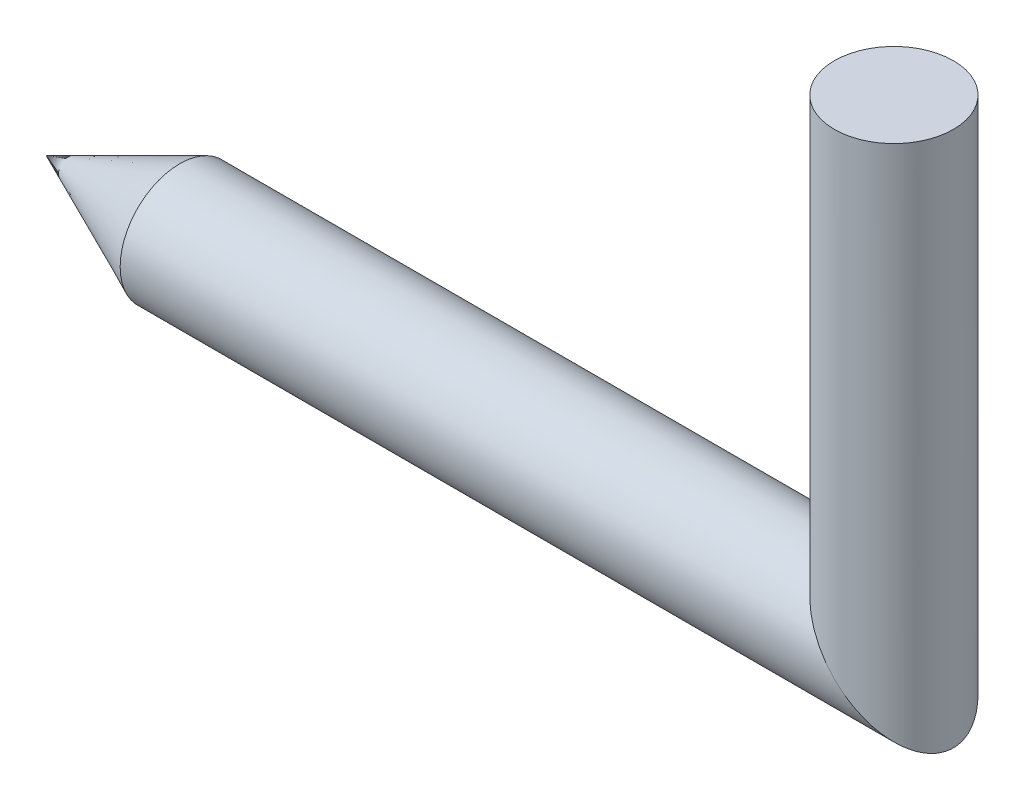
ISO-10303-21;
HEADER;
FILE_DESCRIPTION(('STEP AP214'),'2;1');
FILE_NAME('part.step','',(''),(''),'','','');
FILE_SCHEMA(('AUTOMOTIVE_DESIGN { 1 0 10303 214 1 1 1 1 }'));
ENDSEC;
DATA;
#1=APPLICATION_CONTEXT('core data for automotive mechanical design processes');
#2=APPLICATION_PROTOCOL_DEFINITION('international standard','automotive_design',2000,#1);
#3=PRODUCT_CONTEXT('',#1,'mechanical');
#4=PRODUCT('Part','Part','',(#3));
#5=PRODUCT_RELATED_PRODUCT_CATEGORY('part','',(#4));
#6=PRODUCT_DEFINITION_FORMATION('','',#4);
#7=PRODUCT_DEFINITION_CONTEXT('part definition',#1,'design');
#8=PRODUCT_DEFINITION('design','',#6,#7);
#9=PRODUCT_DEFINITION_SHAPE('','',#8);
#10=(LENGTH_UNIT() NAMED_UNIT(*) SI_UNIT(.MILLI.,.METRE.));
#11=(NAMED_UNIT(*) PLANE_ANGLE_UNIT() SI_UNIT($,.RADIAN.));
#12=(NAMED_UNIT(*) SI_UNIT($,.STERADIAN.) SOLID_ANGLE_UNIT());
#13=UNCERTAINTY_MEASURE_WITH_UNIT(LENGTH_MEASURE(1.E-05),#10,'distance_accuracy_value','');
#14=(GEOMETRIC_REPRESENTATION_CONTEXT(3) GLOBAL_UNCERTAINTY_ASSIGNED_CONTEXT((#13)) GLOBAL_UNIT_ASSIGNED_CONTEXT((#10,
#11,#12)) REPRESENTATION_CONTEXT('',''));
#15=CARTESIAN_POINT('',(0.,0.,0.));
#16=DIRECTION('',(0.,0.,1.));
#17=DIRECTION('',(1.,0.,0.));
#18=AXIS2_PLACEMENT_3D('',#15,#16,#17);
#19=CARTESIAN_POINT('',(40.1728214285714,4.,0.));
#20=DIRECTION('',(0.,-1.,0.));
#21=DIRECTION('',(0.,0.,-1.));
#22=AXIS2_PLACEMENT_3D('',#19,#20,#21);
#23=PLANE('',#22);
#24=CARTESIAN_POINT('',(40.1728214285714,4.,0.));
#25=DIRECTION('',(0.,-1.,0.));
#26=DIRECTION('',(0.,0.,-1.));
#27=AXIS2_PLACEMENT_3D('',#24,#25,#26);
#28=CIRCLE('',#27,0.499999999999999);
#29=CARTESIAN_POINT('',(40.1728214285714,4.,-0.499999999999999));
#30=VERTEX_POINT('',#29);
#31=CARTESIAN_POINT('',(40.1728214285714,4.,0.499999999999999));
#32=VERTEX_POINT('',#31);
#33=EDGE_CURVE('E110',#30,#32,#28,.T.);
#34=ORIENTED_EDGE('',*,*,#33,.F.);
#35=CARTESIAN_POINT('',(40.1728214285714,4.,0.));
#36=DIRECTION('',(0.,-1.,0.));
#37=DIRECTION('',(0.,0.,1.));
#38=AXIS2_PLACEMENT_3D('',#35,#36,#37);
#39=CIRCLE('',#38,0.499999999999999);
#40=EDGE_CURVE('E46',#32,#30,#39,.T.);
#41=ORIENTED_EDGE('',*,*,#40,.F.);
#42=EDGE_LOOP('',(#34,#41));
#43=FACE_BOUND('',#42,.T.);
#44=ADVANCED_FACE('F17',(#43),#23,.F.);
#45=CARTESIAN_POINT('',(40.1728214285714,-1.41421356237309,0.));
#46=DIRECTION('',(0.,1.,0.));
#47=DIRECTION('',(0.,0.,1.));
#48=AXIS2_PLACEMENT_3D('',#45,#46,#47);
#49=CYLINDRICAL_SURFACE('',#48,0.499999999999999);
#50=ORIENTED_EDGE('',*,*,#40,.T.);
#51=ORIENTED_EDGE('',*,*,#33,.T.);
#52=EDGE_LOOP('',(#50,#51));
#53=FACE_BOUND('',#52,.T.);
#54=CARTESIAN_POINT('',(40.1728214285714,0.,-0.499999999999999));
#55=CARTESIAN_POINT('',(40.1808258770451,-0.00800462596818887,-0.500000062859919));
#56=CARTESIAN_POINT('',(40.18882338737,-0.0160161615342709,-0.49980777770303));
#57=CARTESIAN_POINT('',(40.2044063482008,-0.0316405871049813,-0.499056073616842));
#58=CARTESIAN_POINT('',(40.2119925995997,-0.0392535796249538,-0.498515299127215));
#59=CARTESIAN_POINT('',(40.2267531842289,-0.0540679192011858,-0.497120806904106));
#60=CARTESIAN_POINT('',(40.2339283958437,-0.061270057925543,-0.496284851984697));
#61=CARTESIAN_POINT('',(40.2478663753892,-0.0752540251521456,-0.494351980330579));
#62=CARTESIAN_POINT('',(40.2546301489241,-0.0820372101219608,-0.493271920677648));
#63=CARTESIAN_POINT('',(40.2737148141889,-0.101159566048117,-0.489820737939862));
#64=CARTESIAN_POINT('',(40.2860139955228,-0.113462864420223,-0.487119843324512));
#65=CARTESIAN_POINT('',(40.3089561552806,-0.136361279048699,-0.481172713299647));
#66=CARTESIAN_POINT('',(40.3196106892455,-0.146974499951634,-0.478039641209304));
#67=CARTESIAN_POINT('',(40.3392649548062,-0.166530877704814,-0.471548151295753));
#68=CARTESIAN_POINT('',(40.3482794951192,-0.175491946102582,-0.468289168023491));
#69=CARTESIAN_POINT('',(40.3598638169249,-0.187047893704693,-0.463703683429975));
#70=CARTESIAN_POINT('',(40.3624994916898,-0.189679852897997,-0.462633392658503));
#71=CARTESIAN_POINT('',(40.3701995772378,-0.197374697609671,-0.459427213122713));
#72=CARTESIAN_POINT('',(40.3752475563697,-0.202426385708231,-0.457224352800346));
#73=CARTESIAN_POINT('',(40.38518366954,-0.212367655615882,-0.452690983783474));
#74=CARTESIAN_POINT('',(40.3900727548308,-0.217258240228251,-0.450364742574222));
#75=CARTESIAN_POINT('',(40.4020196744271,-0.229209215774169,-0.444438534796396));
#76=CARTESIAN_POINT('',(40.4090532068534,-0.236245475651034,-0.440740213984835));
#77=CARTESIAN_POINT('',(40.4227557464451,-0.249950004498757,-0.433109912377635));
#78=CARTESIAN_POINT('',(40.4294285584058,-0.256622203867162,-0.429191812592159));
#79=CARTESIAN_POINT('',(40.4424091859897,-0.269599296616404,-0.421155777032965));
#80=CARTESIAN_POINT('',(40.4487211465935,-0.27590842506901,-0.417051398275466));
#81=CARTESIAN_POINT('',(40.4609799746346,-0.288161306666444,-0.408675813571791));
#82=CARTESIAN_POINT('',(40.4669313529585,-0.294109586492024,-0.404417825388286));
#83=CARTESIAN_POINT('',(40.4804405915276,-0.307619600043425,-0.394285280231199));
#84=CARTESIAN_POINT('',(40.4879571769,-0.315142372606498,-0.388303105499883));
#85=CARTESIAN_POINT('',(40.5025170612147,-0.329719969072467,-0.375995696684533));
#86=CARTESIAN_POINT('',(40.5095678035592,-0.33678205674767,-0.369687881909127));
#87=CARTESIAN_POINT('',(40.5231962255081,-0.350430870893242,-0.356768235910187));
#88=CARTESIAN_POINT('',(40.5297818372824,-0.357025592907368,-0.3501732504996));
#89=CARTESIAN_POINT('',(40.5424792808253,-0.36973526871669,-0.336717387512189));
#90=CARTESIAN_POINT('',(40.5485995888067,-0.375858888348221,-0.329872718986967));
#91=CARTESIAN_POINT('',(40.5603659540319,-0.387624728535094,-0.315954552615892));
#92=CARTESIAN_POINT('',(40.5660210444184,-0.393276219558549,-0.308896558412153));
#93=CARTESIAN_POINT('',(40.5768562730151,-0.40409859827958,-0.294587903587665));
#94=CARTESIAN_POINT('',(40.5820460228297,-0.409279293915162,-0.287351956499175));
#95=CARTESIAN_POINT('',(40.5919504087428,-0.41916380363992,-0.272721368453345));
#96=CARTESIAN_POINT('',(40.5966752200871,-0.423877863955285,-0.265340599243199));
#97=CARTESIAN_POINT('',(40.6034629547782,-0.430652607554994,-0.254080429026748));
#98=CARTESIAN_POINT('',(40.6056483324816,-0.43283420802769,-0.250346601656918));
#99=CARTESIAN_POINT('',(40.6099012883569,-0.437081782542643,-0.24285333243717));
#100=CARTESIAN_POINT('',(40.6119702471045,-0.439149100855252,-0.239095439196193));
#101=CARTESIAN_POINT('',(40.6164325726917,-0.44361080512606,-0.230729736426458));
#102=CARTESIAN_POINT('',(40.6188076916631,-0.445987543183258,-0.226102741772971));
#103=CARTESIAN_POINT('',(40.6234032493723,-0.450588497940241,-0.216787094437801));
#104=CARTESIAN_POINT('',(40.6256252890921,-0.452814287483027,-0.212100008772119));
#105=CARTESIAN_POINT('',(40.6299145876435,-0.45711232847213,-0.20266927389777));
#106=CARTESIAN_POINT('',(40.6319834340141,-0.459186151337037,-0.197927064040834));
#107=CARTESIAN_POINT('',(40.6359663922129,-0.463179357986482,-0.188391290612225));
#108=CARTESIAN_POINT('',(40.6378820681792,-0.465100301626229,-0.183599034415392));
#109=CARTESIAN_POINT('',(40.6415587037695,-0.468787045329738,-0.17396833937458));
#110=CARTESIAN_POINT('',(40.6433211957631,-0.470554381997506,-0.169131074591396));
#111=CARTESIAN_POINT('',(40.6466915002553,-0.473933380720213,-0.15941552687578));
#112=CARTESIAN_POINT('',(40.648300803883,-0.475546544286555,-0.154538284165899));
#113=CARTESIAN_POINT('',(40.6513647755155,-0.478616843125686,-0.144747921720732));
#114=CARTESIAN_POINT('',(40.6528208836212,-0.480075432630163,-0.139835709391992));
#115=CARTESIAN_POINT('',(40.6555785187314,-0.482836403468416,-0.129980521521436));
#116=CARTESIAN_POINT('',(40.6568814246424,-0.48414017946404,-0.12503832312099));
#117=CARTESIAN_POINT('',(40.6593327199932,-0.486591515225855,-0.115128242291837));
#118=CARTESIAN_POINT('',(40.6604824167825,-0.487740397855086,-0.11016101096381));
#119=CARTESIAN_POINT('',(40.6626273690277,-0.489882107829851,-0.100205902448933));
#120=CARTESIAN_POINT('',(40.6636238498665,-0.490876174283716,-0.0952185562882048));
#121=CARTESIAN_POINT('',(40.6654624557191,-0.492708578827793,-0.0852282087233508));
#122=CARTESIAN_POINT('',(40.6663057138773,-0.493548060811662,-0.0802256260200576));
#123=CARTESIAN_POINT('',(40.6678379703202,-0.495071785888394,-0.0702097420348519));
#124=CARTESIAN_POINT('',(40.6685279995721,-0.495757066932146,-0.065196756654989));
#125=CARTESIAN_POINT('',(40.6697539032433,-0.496973038384936,-0.0551649439236439));
#126=CARTESIAN_POINT('',(40.6702906970628,-0.49750465104536,-0.0501463409223693));
#127=CARTESIAN_POINT('',(40.6712102468877,-0.498414088636365,-0.040108103103294));
#128=CARTESIAN_POINT('',(40.6715938020715,-0.498792711568324,-0.0350886139442372));
#129=CARTESIAN_POINT('',(40.6722069898342,-0.499397122819158,-0.0250533432934804));
#130=CARTESIAN_POINT('',(40.6724372937424,-0.49962357776539,-0.0200376430678387));
#131=CARTESIAN_POINT('',(40.6727441393316,-0.499924751484598,-0.0100146081853633));
#132=CARTESIAN_POINT('',(40.6728212178286,-0.500000000010175,-0.00500730595011873));
#133=CARTESIAN_POINT('',(40.6728216392403,-0.499999999989826,0.00500554810336426));
#134=CARTESIAN_POINT('',(40.6727450361154,-0.499924804267585,0.0100110999189949));
#135=CARTESIAN_POINT('',(40.6724390426206,-0.499623833992766,0.0200308719159179));
#136=CARTESIAN_POINT('',(40.6722091080759,-0.499397523127314,0.0250450593012584));
#137=CARTESIAN_POINT('',(40.6715966199604,-0.498793477048862,0.0350775460346178));
#138=CARTESIAN_POINT('',(40.6712133878259,-0.498415068547241,0.0400957633177576));
#139=CARTESIAN_POINT('',(40.6702944290915,-0.497506115745724,0.0501317014840988));
#140=CARTESIAN_POINT('',(40.6697578959768,-0.496974766715261,0.0551492754786748));
#141=CARTESIAN_POINT('',(40.6685324630228,-0.495759357217068,0.0651792754307823));
#142=CARTESIAN_POINT('',(40.667842636512,-0.495074367733934,0.0701914753809515));
#143=CARTESIAN_POINT('',(40.6663107336282,-0.493551239140941,0.080206033571295));
#144=CARTESIAN_POINT('',(40.6654676191147,-0.492712055313031,0.0852080738363842));
#145=CARTESIAN_POINT('',(40.6636292488147,-0.49088023908375,0.0951975801174043));
#146=CARTESIAN_POINT('',(40.6626328528766,-0.489886456047749,0.100184624962076));
#147=CARTESIAN_POINT('',(40.6604880184271,-0.487745283593042,0.1101393716429));
#148=CARTESIAN_POINT('',(40.6593383477405,-0.486596648377374,0.115106539609151));
#149=CARTESIAN_POINT('',(40.656887052375,-0.484145756922506,0.125016730384476));
#150=CARTESIAN_POINT('',(40.6555841138141,-0.482842171206439,0.129959098903867));
#151=CARTESIAN_POINT('',(40.6528263609165,-0.480081509384491,0.13981485822297));
#152=CARTESIAN_POINT('',(40.6513701614366,-0.478623032096157,0.144727468377881));
#153=CARTESIAN_POINT('',(40.6483059542092,-0.475552865398162,0.154518850860705));
#154=CARTESIAN_POINT('',(40.6466965004474,-0.473939715343995,0.159396711995772));
#155=CARTESIAN_POINT('',(40.6433258427053,-0.4705606308844,0.169113712891355));
#156=CARTESIAN_POINT('',(40.6415631420289,-0.468793188672451,0.17395180839297));
#157=CARTESIAN_POINT('',(40.6378860349853,-0.465106101269415,0.183584371422118));
#158=CARTESIAN_POINT('',(40.635970091029,-0.463184913306386,0.188377660628097));
#159=CARTESIAN_POINT('',(40.6319865452727,-0.459191065229043,0.197915697041001));
#160=CARTESIAN_POINT('',(40.6299173745131,-0.457116839212811,0.202659132434428));
#161=CARTESIAN_POINT('',(40.6256273643276,-0.452817822581532,0.212092498744404));
#162=CARTESIAN_POINT('',(40.623404932765,-0.450591454662736,0.216780985644792));
#163=CARTESIAN_POINT('',(40.6188085696686,-0.445989146267808,0.226099619705563));
#164=CARTESIAN_POINT('',(40.6164330334588,-0.443611627071328,0.23072819526816));
#165=CARTESIAN_POINT('',(40.6119712924687,-0.439149845434915,0.239094043116086));
#166=CARTESIAN_POINT('',(40.6099034071314,-0.437083299720565,0.242850573928796));
#167=CARTESIAN_POINT('',(40.605652436156,-0.432837241801411,0.250341333055881));
#168=CARTESIAN_POINT('',(40.6034679642764,-0.43065638221739,0.25407400790064));
#169=CARTESIAN_POINT('',(40.5966825842741,-0.423883615483149,0.265331341710958));
#170=CARTESIAN_POINT('',(40.5919591645113,-0.419170865792663,0.272710446427319));
#171=CARTESIAN_POINT('',(40.5820570302946,-0.409288677329495,0.287338552470153));
#172=CARTESIAN_POINT('',(40.5768681068211,-0.404108966611814,0.294573642434334));
#173=CARTESIAN_POINT('',(40.5660340016578,-0.393288141579343,0.308881366972304));
#174=CARTESIAN_POINT('',(40.5603791793908,-0.387637193541325,0.315939247343194));
#175=CARTESIAN_POINT('',(40.5486128135364,-0.375871914692555,0.329857888122317));
#176=CARTESIAN_POINT('',(40.5424922118165,-0.369748287847508,0.336703102933104));
#177=CARTESIAN_POINT('',(40.5297936459435,-0.357037965762128,0.350160668605226));
#178=CARTESIAN_POINT('',(40.523207184377,-0.350442579301669,0.356756767291213));
#179=CARTESIAN_POINT('',(40.5095765034406,-0.336791722648332,0.369679130639859));
#180=CARTESIAN_POINT('',(40.5025243331078,-0.329728232510218,0.375988504619299));
#181=CARTESIAN_POINT('',(40.4879611129567,-0.315146978106003,0.388299439751215));
#182=CARTESIAN_POINT('',(40.4804426063818,-0.30762192459429,0.3942835365374));
#183=CARTESIAN_POINT('',(40.4669344310569,-0.294112425630432,0.404415696239264));
#184=CARTESIAN_POINT('',(40.4609861713826,-0.288167049952439,0.408671700278648));
#185=CARTESIAN_POINT('',(40.4487321331566,-0.275918814597724,0.417044491345025));
#186=CARTESIAN_POINT('',(40.4424218129123,-0.269611409633306,0.421147989059154));
#187=CARTESIAN_POINT('',(40.4294430791484,-0.256636434326446,0.429183298412372));
#188=CARTESIAN_POINT('',(40.4227704970146,-0.249964606915489,0.433101480010739));
#189=CARTESIAN_POINT('',(40.4090670089847,-0.236259386903452,0.440732781777762));
#190=CARTESIAN_POINT('',(40.4020322776575,-0.229222041303757,0.44443194437175));
#191=CARTESIAN_POINT('',(40.3900825839064,-0.217268377027409,0.450359874218176));
#192=CARTESIAN_POINT('',(40.3851919078807,-0.212376206873126,0.452686993927848));
#193=CARTESIAN_POINT('',(40.3752519951893,-0.202431041349987,0.457222322141211));
#194=CARTESIAN_POINT('',(40.3702018030704,-0.197377036115143,0.459426238769637));
#195=CARTESIAN_POINT('',(40.3625003321582,-0.189680633619431,0.462633067346854));
#196=CARTESIAN_POINT('',(40.3598655035767,-0.187049455654109,0.463703048151197));
#197=CARTESIAN_POINT('',(40.348283915442,-0.175496008847807,0.46828760836697));
#198=CARTESIAN_POINT('',(40.3392712127112,-0.166536735214202,0.471546045256715));
#199=CARTESIAN_POINT('',(40.319619638084,-0.146983029132158,0.478036999087157));
#200=CARTESIAN_POINT('',(40.3089659437281,-0.136370680069815,0.48117002941891));
#201=CARTESIAN_POINT('',(40.2860244603208,-0.113473043075842,0.487117477063616));
#202=CARTESIAN_POINT('',(40.2737251056514,-0.101169639786786,0.489818661659087));
#203=CARTESIAN_POINT('',(40.2546398041921,-0.0820467348589438,0.49327034293386));
#204=CARTESIAN_POINT('',(40.2478755667334,-0.0752631122083733,0.494350603356576));
#205=CARTESIAN_POINT('',(40.2339364068677,-0.0612780093233912,0.496283880767108));
#206=CARTESIAN_POINT('',(40.2267604782099,-0.0540751712684048,0.497120028541817));
#207=CARTESIAN_POINT('',(40.211998207181,-0.0392591711125806,0.498514873673628));
#208=CARTESIAN_POINT('',(40.2044109859273,-0.0316452163544067,0.499055794896943));
#209=CARTESIAN_POINT('',(40.1888258327876,-0.0160186066110532,0.499807718976518));
#210=CARTESIAN_POINT('',(40.1808270995866,-0.00800584869174295,0.500000062892804));
#211=CARTESIAN_POINT('',(40.1728214285714,0.,0.499999999999999));
#212=B_SPLINE_CURVE_WITH_KNOTS('',3,(#54,#55,#56,#57,#58,#59,#60,#61,#62,#63,#64,#65,#66,#67,
#68,#69,#70,#71,#72,#73,#74,#75,#76,#77,#78,#79,#80,#81,#82,#83,#84,#85,#86,#87,#88,#89,#90,#91,
#92,#93,#94,#95,#96,#97,#98,#99,#100,#101,#102,#103,#104,#105,#106,#107,#108,#109,#110,#111,
#112,#113,#114,#115,#116,#117,#118,#119,#120,#121,#122,#123,#124,#125,#126,#127,#128,#129,#130,
#131,#132,#133,#134,#135,#136,#137,#138,#139,#140,#141,#142,#143,#144,#145,#146,#147,#148,#149,
#150,#151,#152,#153,#154,#155,#156,#157,#158,#159,#160,#161,#162,#163,#164,#165,#166,#167,#168,
#169,#170,#171,#172,#173,#174,#175,#176,#177,#178,#179,#180,#181,#182,#183,#184,#185,#186,#187,
#188,#189,#190,#191,#192,#193,#194,#195,#196,#197,#198,#199,#200,#201,#202,#203,#204,#205,#206,
#207,#208,#209,#210,#211),.UNSPECIFIED.,.F.,.F.,(4,2,2,2,2,2,2,2,2,2,2,2,2,2,2,2,2,2,2,2,2,2,2,
2,2,2,2,2,2,2,2,2,2,2,2,2,2,2,2,2,2,2,2,2,2,2,2,2,2,2,2,2,2,2,2,2,2,2,2,2,2,2,2,2,2,2,2,2,2,2,2,
2,2,2,2,2,2,2,4),(0.,0.0339586406442457,0.0662363135188411,0.0968331423694916,0.125749277144156,
0.178535352825531,0.22460293178514,0.263954770903021,0.275581098482625,0.297999007001341,
0.31988513839005,0.351719081411149,0.382364365736235,0.411826404427256,0.440111290709398,
0.476699472583539,0.512100979040122,0.546336986893967,0.579430910709766,0.611408674170542,
0.642299011463479,0.672133799155613,0.686667842361629,0.700951577136551,0.718102562635668,
0.73503214420973,0.75175011085617,0.768266627836283,0.784592236718297,0.800737853010075,
0.816714761139627,0.832534606562132,0.848209384802487,0.863751427282936,0.879173383836457,
0.894488201867213,0.909709102188832,0.924849551647232,0.939923232714817,0.954944010323937,
0.969959514793083,0.985028595072029,1.00016512932367,1.01538281116255,1.03069511649649,
1.04611527315639,1.06165623357937,1.07733065072937,1.09315085735817,1.10912884863424,
1.12527626809699,1.14160439683342,1.15812414572354,1.17484605056049,1.19178026982139,
1.20893658484487,1.22321468968382,1.23774384168937,1.26757108400967,1.29845688214522,
1.3304331303519,1.3635285701601,1.39776912461406,1.4331782015779,1.46977696664692,
1.4980477725979,1.52750222637272,1.55814642693311,1.58998578880096,1.61187914519086,
1.63430716722501,1.64592992006704,1.6852738940222,1.731337897323,1.78412468815931,
1.81304279019104,1.84364265936011,1.87592444559192,1.90988827259449),.UNSPECIFIED.);
#213=CARTESIAN_POINT('',(40.1728214285714,0.,-0.499999999999999));
#214=VERTEX_POINT('',#213);
#215=CARTESIAN_POINT('',(40.1728214285714,0.,0.499999999999999));
#216=VERTEX_POINT('',#215);
#217=EDGE_CURVE('E28',#214,#216,#212,.T.);
#218=ORIENTED_EDGE('',*,*,#217,.F.);
#219=CARTESIAN_POINT('',(40.1728214285714,0.,0.499999999999999));
#220=CARTESIAN_POINT('',(40.1648169801271,0.00800462593433612,0.500000062859916));
#221=CARTESIAN_POINT('',(40.1568194698318,0.0160161614667269,0.499807777704656));
#222=CARTESIAN_POINT('',(40.1412365090539,0.031640586977252,0.49905607362453));
#223=CARTESIAN_POINT('',(40.1336502576784,0.0392535794707017,0.498515299138955));
#224=CARTESIAN_POINT('',(40.1188896730899,0.0540679190011764,0.497120806925569));
#225=CARTESIAN_POINT('',(40.1117144614924,0.0612700577062536,0.496284852011483));
#226=CARTESIAN_POINT('',(40.0977764819754,0.0752540249015649,0.494351980368545));
#227=CARTESIAN_POINT('',(40.0910127084517,0.0820372098593116,0.493271920721154));
#228=CARTESIAN_POINT('',(40.0719280432017,0.101159565769745,0.489820737997216));
#229=CARTESIAN_POINT('',(40.0596288618718,0.113462864138851,0.487119843389948));
#230=CARTESIAN_POINT('',(40.0366867020977,0.136361278788808,0.481172713373815));
#231=CARTESIAN_POINT('',(40.0260321681125,0.146974499715706,0.478039641282398));
#232=CARTESIAN_POINT('',(40.0063779024866,0.166530877542371,0.471548151354136));
#233=CARTESIAN_POINT('',(39.9973633621289,0.175491945989279,0.46828916806701));
#234=CARTESIAN_POINT('',(39.9857790402586,0.187047893661596,0.463703683447501));
#235=CARTESIAN_POINT('',(39.9831433654734,0.189679852876517,0.462633392667453));
#236=CARTESIAN_POINT('',(39.9754432798863,0.19737469763068,0.459427213113959));
#237=CARTESIAN_POINT('',(39.9703953007356,0.202426385749864,0.457224352782186));
#238=CARTESIAN_POINT('',(39.9604591875329,0.212367655692242,0.452690983747846));
#239=CARTESIAN_POINT('',(39.9555701022286,0.217258240318776,0.450364742530746));
#240=CARTESIAN_POINT('',(39.9436231826088,0.22920921588878,0.444438534737508));
#241=CARTESIAN_POINT('',(39.9365896501724,0.236245475775333,0.440740213918426));
#242=CARTESIAN_POINT('',(39.9228871105726,0.249950004629212,0.433109912302308));
#243=CARTESIAN_POINT('',(39.9162142986139,0.256622203994292,0.429191812516099));
#244=CARTESIAN_POINT('',(39.9032336710461,0.269599296724656,0.42115577696337));
#245=CARTESIAN_POINT('',(39.8969217104563,0.275908425161909,0.417051398213703));
#246=CARTESIAN_POINT('',(39.8846628824558,0.288161306717793,0.408675813535021));
#247=CARTESIAN_POINT('',(39.8787115041582,0.294109586517352,0.404417825369292));
#248=CARTESIAN_POINT('',(39.8652022656158,0.307619600043999,0.394285280230765));
#249=CARTESIAN_POINT('',(39.8576856802444,0.315142372607956,0.388303105498715));
#250=CARTESIAN_POINT('',(39.8431257959312,0.329719969075189,0.375995696682173));
#251=CARTESIAN_POINT('',(39.8360750535872,0.336782056750788,0.369687881906304));
#252=CARTESIAN_POINT('',(39.8224466316391,0.350430870896968,0.356768235906536));
#253=CARTESIAN_POINT('',(39.8158610198651,0.357025592911312,0.350173250495586));
#254=CARTESIAN_POINT('',(39.8031635763227,0.369735268720842,0.336717387507638));
#255=CARTESIAN_POINT('',(39.7970432683414,0.375858888352369,0.329872718982243));
#256=CARTESIAN_POINT('',(39.7852769031162,0.387624728539061,0.315954552611024));
#257=CARTESIAN_POINT('',(39.7796218127296,0.393276219562343,0.308896558407315));
#258=CARTESIAN_POINT('',(39.7687865841325,0.404098598282884,0.294587903583124));
#259=CARTESIAN_POINT('',(39.7635968343176,0.409279293918154,0.287351956494899));
#260=CARTESIAN_POINT('',(39.7536924484036,0.419163803642178,0.272721368449856));
#261=CARTESIAN_POINT('',(39.7489676370587,0.423877863957128,0.265340599240231));
#262=CARTESIAN_POINT('',(39.7421799023666,0.430652607556188,0.254080429024718));
#263=CARTESIAN_POINT('',(39.7399945246629,0.432834208028652,0.250346601655247));
#264=CARTESIAN_POINT('',(39.7357415687868,0.437081782543125,0.242853332436294));
#265=CARTESIAN_POINT('',(39.7336726100388,0.439149100855487,0.239095439195753));
#266=CARTESIAN_POINT('',(39.7292102844504,0.443610805125962,0.230729736426641));
#267=CARTESIAN_POINT('',(39.7268351654783,0.445987543183073,0.226102741773333));
#268=CARTESIAN_POINT('',(39.7222396077678,0.450588497939905,0.216787094438495));
#269=CARTESIAN_POINT('',(39.7200175680475,0.452814287482629,0.212100008772965));
#270=CARTESIAN_POINT('',(39.715728269495,0.457112328471625,0.202669273898903));
#271=CARTESIAN_POINT('',(39.7136594231239,0.459186151336489,0.197927064042103));
#272=CARTESIAN_POINT('',(39.7096764649241,0.463179357985864,0.188391290613741));
#273=CARTESIAN_POINT('',(39.7077607889574,0.465100301625585,0.183599034417022));
#274=CARTESIAN_POINT('',(39.7040841533664,0.468787045329056,0.173968339376413));
#275=CARTESIAN_POINT('',(39.7023216613725,0.470554381996814,0.169131074593319));
#276=CARTESIAN_POINT('',(39.6989513568797,0.473933380719511,0.159415526877863));
#277=CARTESIAN_POINT('',(39.6973420532518,0.475546544285856,0.15453828416805));
#278=CARTESIAN_POINT('',(39.6942780816189,0.478616843125002,0.144747921722993));
#279=CARTESIAN_POINT('',(39.692821973513,0.480075432629492,0.139835709394296));
#280=CARTESIAN_POINT('',(39.6900643384027,0.48283640346778,0.1299805215238));
#281=CARTESIAN_POINT('',(39.6887614324916,0.484140179463424,0.125038323123373));
#282=CARTESIAN_POINT('',(39.6863101371408,0.486591515225288,0.115128242294231));
#283=CARTESIAN_POINT('',(39.6851604403516,0.487740397854548,0.110161010966197));
#284=CARTESIAN_POINT('',(39.6830154881066,0.489882107829372,0.100205902451277));
#285=CARTESIAN_POINT('',(39.6820190072679,0.490876174283268,0.0952185562905154));
#286=CARTESIAN_POINT('',(39.6801804014157,0.49270857882741,0.0852282087255672));
#287=CARTESIAN_POINT('',(39.6793371432576,0.493548060811312,0.0802256260222139));
#288=CARTESIAN_POINT('',(39.6778048868153,0.49507178588811,0.0702097420368606));
#289=CARTESIAN_POINT('',(39.6771148575638,0.495757066931894,0.0651967566569101));
#290=CARTESIAN_POINT('',(39.6758889538933,0.496973038384746,0.0551649439253638));
#291=CARTESIAN_POINT('',(39.6753521600742,0.497504651045199,0.0501463409239753));
#292=CARTESIAN_POINT('',(39.6744326102502,0.498414088636258,0.0401081031046457));
#293=CARTESIAN_POINT('',(39.6740490550669,0.498792711568241,0.0350886139454481));
#294=CARTESIAN_POINT('',(39.6734358673053,0.499397122819114,0.0250533432943835));
#295=CARTESIAN_POINT('',(39.6732055633977,0.499623577765362,0.0200376430685745));
#296=CARTESIAN_POINT('',(39.6728987178098,0.499924751484593,0.0100146081857384));
#297=CARTESIAN_POINT('',(39.6728216393136,0.500000000010175,0.00500730595030041));
#298=CARTESIAN_POINT('',(39.6728212179032,0.499999999989826,-0.00500554810488856));
#299=CARTESIAN_POINT('',(39.6728978210288,0.49992480426754,-0.0100110999220317));
#300=CARTESIAN_POINT('',(39.673203814525,0.499623833992544,-0.0200308719217746));
#301=CARTESIAN_POINT('',(39.6734337490703,0.499397523126968,-0.0250450593084226));
#302=CARTESIAN_POINT('',(39.6740462371868,0.498793477048201,-0.0350775460441877));
#303=CARTESIAN_POINT('',(39.6744294693219,0.498415068546394,-0.0400957633284263));
#304=CARTESIAN_POINT('',(39.6753484280572,0.497506115744458,-0.0501317014967548));
#305=CARTESIAN_POINT('',(39.6758849611723,0.496974766713767,-0.0551492754922202));
#306=CARTESIAN_POINT('',(39.677110394127,0.495759357215089,-0.0651792754458938));
#307=CARTESIAN_POINT('',(39.6778002206381,0.495074367731702,-0.0701914753967412));
#308=CARTESIAN_POINT('',(39.6793321235225,0.493551239138195,-0.0802060335882298));
#309=CARTESIAN_POINT('',(39.6801752380363,0.492712055310026,-0.085208073853788));
#310=CARTESIAN_POINT('',(39.6820136083366,0.490880239080237,-0.0951975801355349));
#311=CARTESIAN_POINT('',(39.6830100042748,0.489886456043991,-0.100184624980466));
#312=CARTESIAN_POINT('',(39.6851548387246,0.48774528358882,-0.110139371661603));
#313=CARTESIAN_POINT('',(39.6863045094112,0.486596648372938,-0.115106539627908));
#314=CARTESIAN_POINT('',(39.6887558047766,0.484145756917686,-0.125016730403138));
#315=CARTESIAN_POINT('',(39.6900587433375,0.482842171201454,-0.129959098922382));
#316=CARTESIAN_POINT('',(39.6928164962349,0.48008150937924,-0.13981485824099));
#317=CARTESIAN_POINT('',(39.6942726957146,0.478623032090809,-0.144727468395556));
#318=CARTESIAN_POINT('',(39.6973369029417,0.4755528653927,-0.154518850877498));
#319=CARTESIAN_POINT('',(39.6989463567033,0.473939715338521,-0.15939671201203));
#320=CARTESIAN_POINT('',(39.7023170144448,0.470560630879001,-0.169113712906357));
#321=CARTESIAN_POINT('',(39.7040797151209,0.468793188667143,-0.173951808407253));
#322=CARTESIAN_POINT('',(39.7077568221638,0.465106101264404,-0.183584371434785));
#323=CARTESIAN_POINT('',(39.7096727661196,0.463184913301586,-0.188377660639873));
#324=CARTESIAN_POINT('',(39.713656311875,0.459191065224799,-0.19791569705082));
#325=CARTESIAN_POINT('',(39.7157254826342,0.457116839208916,-0.202659132443185));
#326=CARTESIAN_POINT('',(39.7200154928185,0.45281782257848,-0.212092498750887));
#327=CARTESIAN_POINT('',(39.7222379243805,0.450591454660183,-0.216780985650066));
#328=CARTESIAN_POINT('',(39.7268342874757,0.445989146266428,-0.226099619708252));
#329=CARTESIAN_POINT('',(39.7292098236848,0.443611627070627,-0.230728195269475));
#330=CARTESIAN_POINT('',(39.7336715646766,0.439149845432463,-0.239094043120685));
#331=CARTESIAN_POINT('',(39.7357394500164,0.437083299715556,-0.242850573937903));
#332=CARTESIAN_POINT('',(39.7399904209964,0.432837241791395,-0.250341333073276));
#333=CARTESIAN_POINT('',(39.7421748928781,0.430656382204934,-0.254074007921829));
#334=CARTESIAN_POINT('',(39.7489602728857,0.42388361546414,-0.265331341741558));
#335=CARTESIAN_POINT('',(39.7536836926518,0.419170865769326,-0.272710446463408));
#336=CARTESIAN_POINT('',(39.7635858268738,0.409288677298499,-0.287338552514436));
#337=CARTESIAN_POINT('',(39.7687747503492,0.404108966577569,-0.294573642481436));
#338=CARTESIAN_POINT('',(39.7796088555151,0.393288141539971,-0.308881367022478));
#339=CARTESIAN_POINT('',(39.7852636777828,0.38763719350016,-0.315939247393738));
#340=CARTESIAN_POINT('',(39.7970300436371,0.375871914649532,-0.329857888171306));
#341=CARTESIAN_POINT('',(39.8031506453564,0.369748287804503,-0.336703102980286));
#342=CARTESIAN_POINT('',(39.8158492112268,0.357037965721258,-0.350160668646793));
#343=CARTESIAN_POINT('',(39.8224356727913,0.350442579263,-0.356756767329093));
#344=CARTESIAN_POINT('',(39.8360663537223,0.336791722616358,-0.36967913066881));
#345=CARTESIAN_POINT('',(39.8431185240517,0.329728232482817,-0.375988504643137));
#346=CARTESIAN_POINT('',(39.8576817441953,0.315146978090786,-0.388299439763336));
#347=CARTESIAN_POINT('',(39.8652002507661,0.307621924586774,-0.394283536543041));
#348=CARTESIAN_POINT('',(39.8787084261212,0.294112425597143,-0.404415696264227));
#349=CARTESIAN_POINT('',(39.884656685831,0.288167049884983,-0.408671700326956));
#350=CARTESIAN_POINT('',(39.8969107241117,0.275918814475674,-0.41704449142617));
#351=CARTESIAN_POINT('',(39.9032210443748,0.269611409491056,-0.421147989150615));
#352=CARTESIAN_POINT('',(39.9161997781604,0.256636434159367,-0.429183298512341));
#353=CARTESIAN_POINT('',(39.9228723602968,0.249964606744042,-0.433101480109746));
#354=CARTESIAN_POINT('',(39.9365758483159,0.236259386740102,-0.440732781865038));
#355=CARTESIAN_POINT('',(39.9436105796293,0.229222041153143,-0.444431944449144));
#356=CARTESIAN_POINT('',(39.9555602733488,0.217268376908418,-0.450359874275326));
#357=CARTESIAN_POINT('',(39.9604509493563,0.21237620677276,-0.452686993974679));
#358=CARTESIAN_POINT('',(39.9703908620043,0.202431041295284,-0.457222322165071));
#359=CARTESIAN_POINT('',(39.9754410540977,0.197377036087563,-0.459426238781128));
#360=CARTESIAN_POINT('',(39.9831425249647,0.189680633640564,-0.462633067338049));
#361=CARTESIAN_POINT('',(39.9857773535262,0.187049455696518,-0.463703048133951));
#362=CARTESIAN_POINT('',(39.9973589415975,0.175496008959336,-0.468287608324131));
#363=CARTESIAN_POINT('',(40.0063716442844,0.166536735374073,-0.471546045199254));
#364=CARTESIAN_POINT('',(40.0260232188476,0.146983029364335,-0.478036999015221));
#365=CARTESIAN_POINT('',(40.0366769131836,0.136370680325576,-0.481170029345915));
#366=CARTESIAN_POINT('',(40.0596183965749,0.113473043352745,-0.487117476999212));
#367=CARTESIAN_POINT('',(40.0719177512483,0.10116964006073,-0.48981866160264));
#368=CARTESIAN_POINT('',(40.0910030527221,0.0820467351174082,-0.493270342891042));
#369=CARTESIAN_POINT('',(40.0977672901918,0.075263112454963,-0.49435060331921));
#370=CARTESIAN_POINT('',(40.1117064500854,0.0612780095391893,-0.496283880740745));
#371=CARTESIAN_POINT('',(40.1188823787602,0.0540751714652292,-0.497120028520693));
#372=CARTESIAN_POINT('',(40.133644649829,0.0392591712643765,-0.498514873662074));
#373=CARTESIAN_POINT('',(40.1412318711058,0.0316452164801028,-0.499055794889376));
#374=CARTESIAN_POINT('',(40.1568170242974,0.0160186066775242,-0.499807718974917));
#375=CARTESIAN_POINT('',(40.1648157575274,0.00800584872506005,-0.500000062892806));
#376=CARTESIAN_POINT('',(40.1728214285714,0.,-0.499999999999999));
#377=B_SPLINE_CURVE_WITH_KNOTS('',3,(#219,#220,#221,#222,#223,#224,#225,#226,#227,#228,#229,
#230,#231,#232,#233,#234,#235,#236,#237,#238,#239,#240,#241,#242,#243,#244,#245,#246,#247,#248,
#249,#250,#251,#252,#253,#254,#255,#256,#257,#258,#259,#260,#261,#262,#263,#264,#265,#266,#267,
#268,#269,#270,#271,#272,#273,#274,#275,#276,#277,#278,#279,#280,#281,#282,#283,#284,#285,#286,
#287,#288,#289,#290,#291,#292,#293,#294,#295,#296,#297,#298,#299,#300,#301,#302,#303,#304,#305,
#306,#307,#308,#309,#310,#311,#312,#313,#314,#315,#316,#317,#318,#319,#320,#321,#322,#323,#324,
#325,#326,#327,#328,#329,#330,#331,#332,#333,#334,#335,#336,#337,#338,#339,#340,#341,#342,#343,
#344,#345,#346,#347,#348,#349,#350,#351,#352,#353,#354,#355,#356,#357,#358,#359,#360,#361,#362,
#363,#364,#365,#366,#367,#368,#369,#370,#371,#372,#373,#374,#375,#376),.UNSPECIFIED.,.F.,.F.,(4,
2,2,2,2,2,2,2,2,2,2,2,2,2,2,2,2,2,2,2,2,2,2,2,2,2,2,2,2,2,2,2,2,2,2,2,2,2,2,2,2,2,2,2,2,2,2,2,2,
2,2,2,2,2,2,2,2,2,2,2,2,2,2,2,2,2,2,2,2,2,2,2,2,2,2,2,2,2,4),(0.,0.0339586405101659,
0.0662363132784079,0.0968331420504384,0.125749276774224,0.178535352437091,0.224602931489251,
0.263954770810839,0.275581098483084,0.297999007090128,0.31988513854195,0.351719081610395,
0.382364365926008,0.411826404550709,0.440111290709696,0.476699472584611,0.512100979041806,
0.546336986896055,0.579430910712005,0.61140867417262,0.642299011465025,0.672133799156192,
0.686667842361541,0.700951577135657,0.718102562635109,0.735032144209419,0.75175011085603,
0.768266627836249,0.784592236718321,0.800737853010123,0.816714761139676,0.83253460656218,
0.848209384802541,0.863751427283024,0.879173383836622,0.894488201867514,0.909709102189346,
0.924849551648052,0.939923232716056,0.954944010325721,0.969959514799439,0.985028595082398,
1.00016512933748,1.0153828111792,1.03069511651537,1.04611527317687,1.06165623360083,
1.07733065075115,1.09315085737962,1.10912884865471,1.12527626811581,1.14160439684992,
1.15812414573705,1.17484605057035,1.19178026982692,1.20893658484541,1.2232146897016,
1.23774384172209,1.26757108406533,1.29845688221462,1.33043313042586,1.36352857022951,
1.3977691246699,1.43317820161119,1.46977696664883,1.49804777276329,1.52750222662616,
1.55814642719913,1.5899857890041,1.61187914531017,1.63430716722698,1.64592991997794,
1.68527389373285,1.73133789694266,1.78412468779717,1.81304278987891,1.84364265912527,
1.87592444546163,1.90988827259599),.UNSPECIFIED.);
#378=EDGE_CURVE('E36',#216,#214,#377,.T.);
#379=ORIENTED_EDGE('',*,*,#378,.F.);
#380=EDGE_LOOP('',(#218,#379));
#381=FACE_BOUND('',#380,.T.);
#382=ADVANCED_FACE('F57',(#53,#381),#49,.T.);
#383=CARTESIAN_POINT('',(34.1728214285695,0.,0.));
#384=DIRECTION('',(1.,0.,0.));
#385=DIRECTION('',(0.,0.,-1.));
#386=AXIS2_PLACEMENT_3D('',#383,#384,#385);
#387=CONICAL_SURFACE('',#386,0.499999999959755,0.41887902046653);
#388=CARTESIAN_POINT('',(33.0498030417061,0.,0.));
#389=VERTEX_POINT('',#388);
#390=VERTEX_LOOP('',#389);
#391=FACE_BOUND('',#390,.T.);
#392=CARTESIAN_POINT('',(34.1728214285714,0.,0.));
#393=DIRECTION('',(-1.,0.,0.));
#394=DIRECTION('',(0.,0.,1.));
#395=AXIS2_PLACEMENT_3D('',#392,#393,#394);
#396=CIRCLE('',#395,0.499999999999999);
#397=CARTESIAN_POINT('',(34.1728214285714,0.,0.499999999999999));
#398=VERTEX_POINT('',#397);
#399=EDGE_CURVE('E11',#398,#398,#396,.F.);
#400=ORIENTED_EDGE('',*,*,#399,.F.);
#401=EDGE_LOOP('',(#400));
#402=FACE_BOUND('',#401,.T.);
#403=ADVANCED_FACE('F53',(#391,#402),#387,.T.);
#404=CARTESIAN_POINT('',(40.1728214285714,0.,0.));
#405=DIRECTION('',(-1.,0.,0.));
#406=DIRECTION('',(0.,0.,1.));
#407=AXIS2_PLACEMENT_3D('',#404,#405,#406);
#408=CYLINDRICAL_SURFACE('',#407,0.499999999999999);
#409=ORIENTED_EDGE('',*,*,#378,.T.);
#410=ORIENTED_EDGE('',*,*,#217,.T.);
#411=EDGE_LOOP('',(#409,#410));
#412=FACE_BOUND('',#411,.T.);
#413=ORIENTED_EDGE('',*,*,#399,.T.);
#414=EDGE_LOOP('',(#413));
#415=FACE_BOUND('',#414,.T.);
#416=ADVANCED_FACE('F56',(#412,#415),#408,.T.);
#417=CLOSED_SHELL('',(#44,#382,#403,#416));
#418=MANIFOLD_SOLID_BREP('B1',#417);
#419=ADVANCED_BREP_SHAPE_REPRESENTATION('',(#18,#418),#14);
#420=SHAPE_DEFINITION_REPRESENTATION(#9,#419);
ENDSEC;
END-ISO-10303-21;
